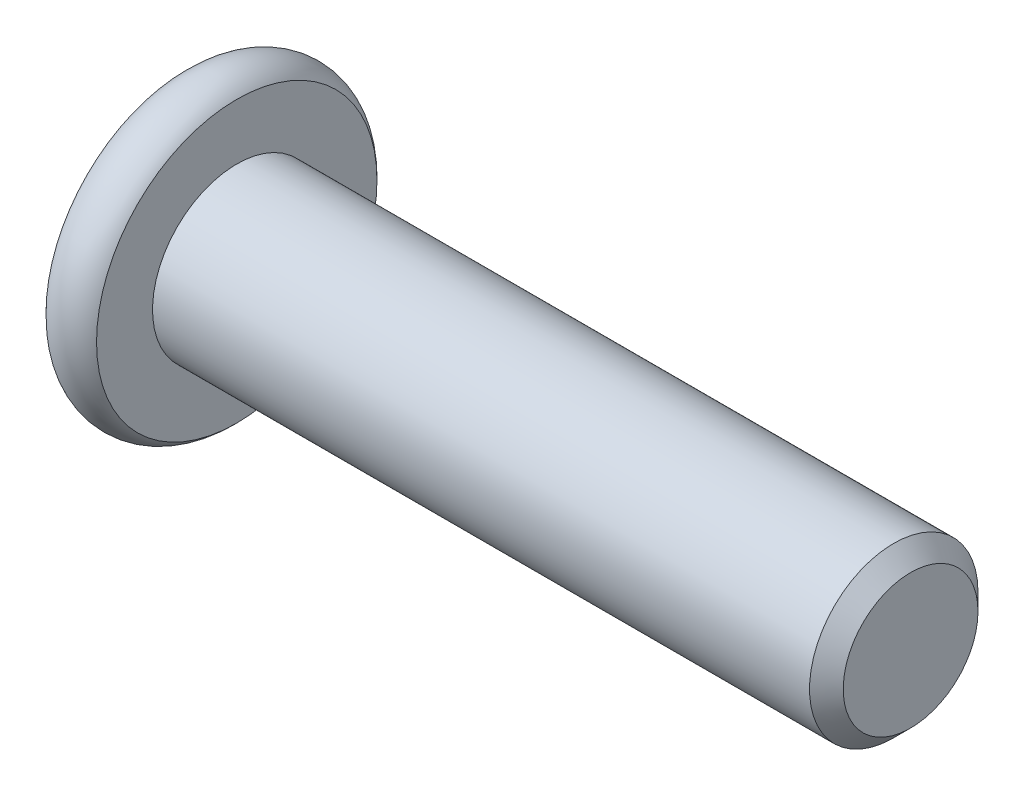
ISO-10303-21;
HEADER;
FILE_DESCRIPTION(('STEP AP214'),'2;1');
FILE_NAME('part.step','',(''),(''),'','','');
FILE_SCHEMA(('AUTOMOTIVE_DESIGN { 1 0 10303 214 1 1 1 1 }'));
ENDSEC;
DATA;
#1=APPLICATION_CONTEXT('core data for automotive mechanical design processes');
#2=APPLICATION_PROTOCOL_DEFINITION('international standard','automotive_design',2000,#1);
#3=PRODUCT_CONTEXT('',#1,'mechanical');
#4=PRODUCT('Part','Part','',(#3));
#5=PRODUCT_RELATED_PRODUCT_CATEGORY('part','',(#4));
#6=PRODUCT_DEFINITION_FORMATION('','',#4);
#7=PRODUCT_DEFINITION_CONTEXT('part definition',#1,'design');
#8=PRODUCT_DEFINITION('design','',#6,#7);
#9=PRODUCT_DEFINITION_SHAPE('','',#8);
#10=(LENGTH_UNIT() NAMED_UNIT(*) SI_UNIT(.MILLI.,.METRE.));
#11=(NAMED_UNIT(*) PLANE_ANGLE_UNIT() SI_UNIT($,.RADIAN.));
#12=(NAMED_UNIT(*) SI_UNIT($,.STERADIAN.) SOLID_ANGLE_UNIT());
#13=UNCERTAINTY_MEASURE_WITH_UNIT(LENGTH_MEASURE(1.E-05),#10,'distance_accuracy_value','');
#14=(GEOMETRIC_REPRESENTATION_CONTEXT(3) GLOBAL_UNCERTAINTY_ASSIGNED_CONTEXT((#13)) GLOBAL_UNIT_ASSIGNED_CONTEXT((#10,
#11,#12)) REPRESENTATION_CONTEXT('',''));
#15=CARTESIAN_POINT('',(0.,0.,0.));
#16=DIRECTION('',(0.,0.,1.));
#17=DIRECTION('',(1.,0.,0.));
#18=AXIS2_PLACEMENT_3D('',#15,#16,#17);
#19=CARTESIAN_POINT('',(-20.,0.,2.22044604925031E-13));
#20=DIRECTION('',(1.,0.,0.));
#21=DIRECTION('',(0.,0.,-1.));
#22=AXIS2_PLACEMENT_3D('',#19,#20,#21);
#23=CYLINDRICAL_SURFACE('',#22,2.5);
#24=CARTESIAN_POINT('',(-0.500000000000056,0.,0.));
#25=DIRECTION('',(1.,0.,0.));
#26=DIRECTION('',(0.,0.,-1.));
#27=AXIS2_PLACEMENT_3D('',#24,#25,#26);
#28=CIRCLE('',#27,2.5);
#29=CARTESIAN_POINT('',(-0.500000000000056,0.,-2.5));
#30=VERTEX_POINT('',#29);
#31=EDGE_CURVE('E51',#30,#30,#28,.F.);
#32=ORIENTED_EDGE('',*,*,#31,.T.);
#33=EDGE_LOOP('',(#32));
#34=FACE_BOUND('',#33,.T.);
#35=CARTESIAN_POINT('',(-20.,0.,2.22044604925031E-13));
#36=DIRECTION('',(-1.,0.,0.));
#37=DIRECTION('',(0.,-1.,0.));
#38=AXIS2_PLACEMENT_3D('',#35,#36,#37);
#39=CIRCLE('',#38,2.5);
#40=CARTESIAN_POINT('',(-20.,-2.50000000000006,2.22183382803109E-13));
#41=VERTEX_POINT('',#40);
#42=EDGE_CURVE('E127',#41,#41,#39,.F.);
#43=ORIENTED_EDGE('',*,*,#42,.T.);
#44=EDGE_LOOP('',(#43));
#45=FACE_BOUND('',#44,.T.);
#46=ADVANCED_FACE('F37',(#34,#45),#23,.T.);
#47=CARTESIAN_POINT('',(0.,0.,0.));
#48=DIRECTION('',(1.,0.,0.));
#49=DIRECTION('',(0.,0.,-1.));
#50=AXIS2_PLACEMENT_3D('',#47,#48,#49);
#51=PLANE('',#50);
#52=CARTESIAN_POINT('',(0.,0.,0.));
#53=DIRECTION('',(1.,0.,0.));
#54=DIRECTION('',(0.,0.,-1.));
#55=AXIS2_PLACEMENT_3D('',#52,#53,#54);
#56=CIRCLE('',#55,2.);
#57=CARTESIAN_POINT('',(0.,0.,-2.));
#58=VERTEX_POINT('',#57);
#59=EDGE_CURVE('E130',#58,#58,#56,.T.);
#60=ORIENTED_EDGE('',*,*,#59,.T.);
#61=EDGE_LOOP('',(#60));
#62=FACE_BOUND('',#61,.T.);
#63=ADVANCED_FACE('F140',(#62),#51,.T.);
#64=CARTESIAN_POINT('',(0.,0.,0.));
#65=DIRECTION('',(-1.,0.,0.));
#66=DIRECTION('',(0.,0.,1.));
#67=AXIS2_PLACEMENT_3D('',#64,#65,#66);
#68=CONICAL_SURFACE('',#67,2.,0.785398163397446);
#69=ORIENTED_EDGE('',*,*,#31,.F.);
#70=EDGE_LOOP('',(#69));
#71=FACE_BOUND('',#70,.T.);
#72=ORIENTED_EDGE('',*,*,#59,.F.);
#73=EDGE_LOOP('',(#72));
#74=FACE_BOUND('',#73,.T.);
#75=ADVANCED_FACE('F39',(#71,#74),#68,.T.);
#76=CARTESIAN_POINT('',(-21.5,0.,2.22044604925031E-13));
#77=DIRECTION('',(1.,0.,0.));
#78=DIRECTION('',(0.,1.,0.));
#79=AXIS2_PLACEMENT_3D('',#76,#77,#78);
#80=PLANE('',#79);
#81=CARTESIAN_POINT('',(-21.5,1.66533453693773E-13,0.));
#82=DIRECTION('',(-1.,0.,0.));
#83=DIRECTION('',(0.,-1.,0.));
#84=AXIS2_PLACEMENT_3D('',#81,#82,#83);
#85=CIRCLE('',#84,1.78205080756886);
#86=CARTESIAN_POINT('',(-21.5,-1.78205080756869,0.));
#87=VERTEX_POINT('',#86);
#88=EDGE_CURVE('E245',#87,#87,#85,.T.);
#89=ORIENTED_EDGE('',*,*,#88,.F.);
#90=EDGE_LOOP('',(#89));
#91=FACE_BOUND('',#90,.T.);
#92=CARTESIAN_POINT('',(-21.5,0.,2.22044604925031E-13));
#93=DIRECTION('',(-1.,0.,0.));
#94=DIRECTION('',(0.,-1.,0.));
#95=AXIS2_PLACEMENT_3D('',#92,#93,#94);
#96=CIRCLE('',#95,4.16143782776615);
#97=CARTESIAN_POINT('',(-21.5,-4.16143782776621,2.22275611129628E-13));
#98=VERTEX_POINT('',#97);
#99=EDGE_CURVE('E124',#98,#98,#96,.T.);
#100=ORIENTED_EDGE('',*,*,#99,.T.);
#101=EDGE_LOOP('',(#100));
#102=FACE_BOUND('',#101,.T.);
#103=ADVANCED_FACE('F139',(#91,#102),#80,.F.);
#104=CARTESIAN_POINT('',(-20.75,0.,2.22044604925031E-13));
#105=DIRECTION('',(-1.,0.,0.));
#106=DIRECTION('',(0.,-1.,0.));
#107=AXIS2_PLACEMENT_3D('',#104,#105,#106);
#108=TOROIDAL_SURFACE('',#107,3.5,1.);
#109=ORIENTED_EDGE('',*,*,#99,.F.);
#110=EDGE_LOOP('',(#109));
#111=FACE_BOUND('',#110,.T.);
#112=CARTESIAN_POINT('',(-20.,0.,2.22044604925031E-13));
#113=DIRECTION('',(-1.,0.,0.));
#114=DIRECTION('',(0.,-1.,0.));
#115=AXIS2_PLACEMENT_3D('',#112,#113,#114);
#116=CIRCLE('',#115,4.16143782776615);
#117=CARTESIAN_POINT('',(-20.,-4.16143782776621,2.22275611129628E-13));
#118=VERTEX_POINT('',#117);
#119=EDGE_CURVE('E121',#118,#118,#116,.T.);
#120=ORIENTED_EDGE('',*,*,#119,.T.);
#121=EDGE_LOOP('',(#120));
#122=FACE_BOUND('',#121,.T.);
#123=ADVANCED_FACE('F151',(#111,#122),#108,.T.);
#124=CARTESIAN_POINT('',(-20.,4.16143782776629,2.22044604925031E-13));
#125=DIRECTION('',(-1.,0.,0.));
#126=DIRECTION('',(0.,-1.,0.));
#127=AXIS2_PLACEMENT_3D('',#124,#125,#126);
#128=PLANE('',#127);
#129=ORIENTED_EDGE('',*,*,#42,.F.);
#130=EDGE_LOOP('',(#129));
#131=FACE_BOUND('',#130,.T.);
#132=ORIENTED_EDGE('',*,*,#119,.F.);
#133=EDGE_LOOP('',(#132));
#134=FACE_BOUND('',#133,.T.);
#135=ADVANCED_FACE('F155',(#131,#134),#128,.F.);
#136=CARTESIAN_POINT('',(-21.5,1.66533453693773E-13,0.));
#137=DIRECTION('',(-1.,0.,0.));
#138=DIRECTION('',(0.,-1.,0.));
#139=AXIS2_PLACEMENT_3D('',#136,#137,#138);
#140=CONICAL_SURFACE('',#139,1.78205080756886,0.78539816339745);
#141=ORIENTED_EDGE('',*,*,#88,.T.);
#142=EDGE_LOOP('',(#141));
#143=FACE_BOUND('',#142,.T.);
#144=CARTESIAN_POINT('',(-22.015428085613,-1.74023253176592,1.50000000000039));
#145=CARTESIAN_POINT('',(-21.9833811073447,-1.69791724929735,1.50000000000032));
#146=CARTESIAN_POINT('',(-21.9516444672843,-1.65536760966792,1.50000000000029));
#147=CARTESIAN_POINT('',(-21.8889203936156,-1.56970398156683,1.50000000000027));
#148=CARTESIAN_POINT('',(-21.8579331482203,-1.52658985542849,1.50000000000028));
#149=CARTESIAN_POINT('',(-21.7658461643452,-1.39562626326564,1.50000000000028));
#150=CARTESIAN_POINT('',(-21.7061145123023,-1.30679868010574,1.50000000000026));
#151=CARTESIAN_POINT('',(-21.5887342891015,-1.12044622640207,1.5000000000003));
#152=CARTESIAN_POINT('',(-21.5314082774826,-1.0227158730666,1.50000000000037));
#153=CARTESIAN_POINT('',(-21.4264632149761,-0.822357214965245,1.50000000000019));
#154=CARTESIAN_POINT('',(-21.3788114236894,-0.719746931702063,1.49999999999994));
#155=CARTESIAN_POINT('',(-21.3205099883151,-0.56585238709519,1.50000000000011));
#156=CARTESIAN_POINT('',(-21.3037990535411,-0.51687419142472,1.50000000000024));
#157=CARTESIAN_POINT('',(-21.2743077515092,-0.41772398845751,1.50000000000032));
#158=CARTESIAN_POINT('',(-21.2615276514222,-0.367551900263887,1.50000000000027));
#159=CARTESIAN_POINT('',(-21.240778420246,-0.267158299056132,1.50000000000028));
#160=CARTESIAN_POINT('',(-21.2327260618263,-0.216954261864853,1.50000000000034));
#161=CARTESIAN_POINT('',(-21.2215916368342,-0.115994915871317,1.50000000000022));
#162=CARTESIAN_POINT('',(-21.2185086886377,-0.0652397064615469,1.50000000000005));
#163=CARTESIAN_POINT('',(-21.2175473897404,0.0344222234875186,1.50000000000006));
#164=CARTESIAN_POINT('',(-21.2194789216953,0.0833271701100345,1.50000000000022));
#165=CARTESIAN_POINT('',(-21.228017572968,0.18072429312715,1.50000000000033));
#166=CARTESIAN_POINT('',(-21.2346251420483,0.229216429361659,1.50000000000028));
#167=CARTESIAN_POINT('',(-21.2522650626449,0.32625802769693,1.50000000000027));
#168=CARTESIAN_POINT('',(-21.2633731682012,0.37479350744994,1.50000000000032));
#169=CARTESIAN_POINT('',(-21.2894198669597,0.470802295834104,1.50000000000024));
#170=CARTESIAN_POINT('',(-21.3043581560035,0.518275688481227,1.50000000000011));
#171=CARTESIAN_POINT('',(-21.3568395457159,0.667150562065092,1.49999999999994));
#172=CARTESIAN_POINT('',(-21.4003351165442,0.766448362426739,1.50000000000019));
#173=CARTESIAN_POINT('',(-21.4970587814838,0.960384405673684,1.50000000000037));
#174=CARTESIAN_POINT('',(-21.5503217226675,1.05500437383609,1.50000000000031));
#175=CARTESIAN_POINT('',(-21.6602258010454,1.23584520321524,1.50000000000025));
#176=CARTESIAN_POINT('',(-21.7165682531047,1.32224986946543,1.50000000000026));
#177=CARTESIAN_POINT('',(-21.8036755725971,1.44954953726468,1.50000000000029));
#178=CARTESIAN_POINT('',(-21.8330199906839,1.49143368482417,1.5000000000003));
#179=CARTESIAN_POINT('',(-21.8924869182931,1.57462914783238,1.50000000000026));
#180=CARTESIAN_POINT('',(-21.9226092115007,1.61594061772573,1.50000000000019));
#181=CARTESIAN_POINT('',(-21.9530541181365,1.65701358742548,1.50000000000006));
#182=B_SPLINE_CURVE_WITH_KNOTS('',3,(#144,#145,#146,#147,#148,#149,#150,#151,#152,#153,#154,
#155,#156,#157,#158,#159,#160,#161,#162,#163,#164,#165,#166,#167,#168,#169,#170,#171,#172,#173,
#174,#175,#176,#177,#178,#179,#180,#181),.UNSPECIFIED.,.F.,.F.,(4,2,2,2,2,2,2,2,2,2,2,2,2,2,2,2,
2,2,4),(0.,0.159238974218315,0.318517535014476,0.639504781932392,0.979137893799231,
1.31760168934353,1.47272233841619,1.62785352839773,1.78016486537347,1.93244917778278,
2.07904486260292,2.22565464958326,2.37484213303392,2.52401777304029,2.8482836528376,
3.17372975666736,3.48303030530528,3.63644667013898,3.78982082222899),.UNSPECIFIED.);
#183=CARTESIAN_POINT('',(-21.4500000000001,-0.866025403784554,1.50000000000028));
#184=VERTEX_POINT('',#183);
#185=CARTESIAN_POINT('',(-21.45,0.866025403784387,1.50000000000017));
#186=VERTEX_POINT('',#185);
#187=EDGE_CURVE('E105',#184,#186,#182,.T.);
#188=ORIENTED_EDGE('',*,*,#187,.F.);
#189=CARTESIAN_POINT('',(-21.4501154816001,-1.73216627762274,-0.000199999999672684));
#190=CARTESIAN_POINT('',(-21.4203654760676,-1.70239359975924,0.0513677907374837));
#191=CARTESIAN_POINT('',(-21.3923624839106,-1.67212305186367,0.103797917665623));
#192=CARTESIAN_POINT('',(-21.3410892304405,-1.61039789003631,0.21070903405604));
#193=CARTESIAN_POINT('',(-21.3178475050447,-1.57893740312624,0.265200195815113));
#194=CARTESIAN_POINT('',(-21.2780337289926,-1.51549879897996,0.375079081357747));
#195=CARTESIAN_POINT('',(-21.2613615856714,-1.48353684526821,0.430438809095736));
#196=CARTESIAN_POINT('',(-21.2356744568184,-1.41890915196216,0.542377257477631));
#197=CARTESIAN_POINT('',(-21.2266402904789,-1.38624538781116,0.598952556553395));
#198=CARTESIAN_POINT('',(-21.218489081227,-1.32995210095303,0.696455389516801));
#199=CARTESIAN_POINT('',(-21.2172822529896,-1.30639533311136,0.737256908280851));
#200=CARTESIAN_POINT('',(-21.2193140571628,-1.25932335290211,0.818787969616243));
#201=CARTESIAN_POINT('',(-21.2225536707488,-1.23580815085328,0.859517494314989));
#202=CARTESIAN_POINT('',(-21.2332919859824,-1.18900414978446,0.940584402163756));
#203=CARTESIAN_POINT('',(-21.2407946530193,-1.16571558211746,0.980921384598634));
#204=CARTESIAN_POINT('',(-21.2596516119287,-1.11952932016346,1.0609183369143));
#205=CARTESIAN_POINT('',(-21.2710075570187,-1.09663179808774,1.10057800851639));
#206=CARTESIAN_POINT('',(-21.3047216475926,-1.03798159809673,1.2021631347746));
#207=CARTESIAN_POINT('',(-21.3296218490937,-1.00259267147477,1.26345855370988));
#208=CARTESIAN_POINT('',(-21.371656653272,-0.950557780604678,1.35358562846354));
#209=CARTESIAN_POINT('',(-21.3864251535596,-0.933410759677447,1.38328513990795));
#210=CARTESIAN_POINT('',(-21.4173105659405,-0.899432101996583,1.44213790138397));
#211=CARTESIAN_POINT('',(-21.4334268341219,-0.882600319285768,1.47129140422083));
#212=CARTESIAN_POINT('',(-21.4501154816001,-0.86590993373048,1.50020000000017));
#213=B_SPLINE_CURVE_WITH_KNOTS('',3,(#189,#190,#191,#192,#193,#194,#195,#196,#197,#198,#199,
#200,#201,#202,#203,#204,#205,#206,#207,#208,#209,#210,#211,#212),.UNSPECIFIED.,.F.,.F.,(4,2,2,
2,2,2,2,2,2,2,2,4),(0.,0.199829143693217,0.400822987382367,0.598623720538195,0.795926240188856,
0.937113067959762,1.07833105577178,1.21968061668202,1.36109089931028,1.58570969637538,
1.69770705470938,1.80965120737165),.UNSPECIFIED.);
#214=CARTESIAN_POINT('',(-21.4500000000001,-1.732050807569,4.44089209850063E-13));
#215=VERTEX_POINT('',#214);
#216=EDGE_CURVE('E201',#215,#184,#213,.T.);
#217=ORIENTED_EDGE('',*,*,#216,.F.);
#218=CARTESIAN_POINT('',(-21.4501154816001,-0.865909933730591,-1.50019999999984));
#219=CARTESIAN_POINT('',(-21.4203654760674,-0.895682611594249,-1.44863220926284));
#220=CARTESIAN_POINT('',(-21.3923624839104,-0.925953159489866,-1.39620208233474));
#221=CARTESIAN_POINT('',(-21.3410892304403,-0.987678321317225,-1.28929096594437));
#222=CARTESIAN_POINT('',(-21.3178475050445,-1.01913880822726,-1.2347998041853));
#223=CARTESIAN_POINT('',(-21.2780337289924,-1.08257741237355,-1.12492091864272));
#224=CARTESIAN_POINT('',(-21.2613615856711,-1.11453936608537,-1.06956119090479));
#225=CARTESIAN_POINT('',(-21.2356744568182,-1.17916705939124,-0.95762274252279));
#226=CARTESIAN_POINT('',(-21.2266402904789,-1.21183082354201,-0.901047443446861));
#227=CARTESIAN_POINT('',(-21.2184890812269,-1.26812411040024,-0.80354461048347));
#228=CARTESIAN_POINT('',(-21.2172822529894,-1.29168087824212,-0.762743091719508));
#229=CARTESIAN_POINT('',(-21.2193140571625,-1.33875285845151,-0.681212030384146));
#230=CARTESIAN_POINT('',(-21.2225536707485,-1.36226806050028,-0.640482505685342));
#231=CARTESIAN_POINT('',(-21.2332919859822,-1.40907206156915,-0.559415597836548));
#232=CARTESIAN_POINT('',(-21.240794653019,-1.43236062923625,-0.519078615401701));
#233=CARTESIAN_POINT('',(-21.2596516119285,-1.47854689119004,-0.439081663085886));
#234=CARTESIAN_POINT('',(-21.2710075570186,-1.50144441326544,-0.399421991483613));
#235=CARTESIAN_POINT('',(-21.3047216475926,-1.56009461325624,-0.297836865225293));
#236=CARTESIAN_POINT('',(-21.3296218490935,-1.5954835398787,-0.236541446290254));
#237=CARTESIAN_POINT('',(-21.3716566532718,-1.64751843074903,-0.146414371536723));
#238=CARTESIAN_POINT('',(-21.3864251535594,-1.66466545167626,-0.116714860092322));
#239=CARTESIAN_POINT('',(-21.4173105659404,-1.69864410935695,-0.057862098616249));
#240=CARTESIAN_POINT('',(-21.4334268341218,-1.71547589206759,-0.0287085957793187));
#241=CARTESIAN_POINT('',(-21.4501154816001,-1.73216627762263,0.000200000000116773));
#242=B_SPLINE_CURVE_WITH_KNOTS('',3,(#218,#219,#220,#221,#222,#223,#224,#225,#226,#227,#228,
#229,#230,#231,#232,#233,#234,#235,#236,#237,#238,#239,#240,#241),.UNSPECIFIED.,.F.,.F.,(4,2,2,
2,2,2,2,2,2,2,2,4),(0.,0.199829143693239,0.400822987382314,0.598623720538103,0.795926240188776,
0.937113067959776,1.07833105577185,1.21968061668216,1.3610908993105,1.58570969637556,
1.69770705470953,1.8096512073718),.UNSPECIFIED.);
#243=CARTESIAN_POINT('',(-21.4500000000001,-0.866025403784554,-1.49999999999995));
#244=VERTEX_POINT('',#243);
#245=EDGE_CURVE('E195',#244,#215,#242,.T.);
#246=ORIENTED_EDGE('',*,*,#245,.F.);
#247=CARTESIAN_POINT('',(-22.015428085613,-1.74023253176575,-1.49999999999972));
#248=CARTESIAN_POINT('',(-21.9833811073446,-1.69791724929724,-1.5));
#249=CARTESIAN_POINT('',(-21.9516444672842,-1.65536760966783,-1.50000000000012));
#250=CARTESIAN_POINT('',(-21.8889203936154,-1.56970398156675,-1.50000000000021));
#251=CARTESIAN_POINT('',(-21.8579331482201,-1.52658985542839,-1.50000000000019));
#252=CARTESIAN_POINT('',(-21.7658461643451,-1.39562626326554,-1.50000000000013));
#253=CARTESIAN_POINT('',(-21.7061145123022,-1.30679868010565,-1.50000000000013));
#254=CARTESIAN_POINT('',(-21.5887342891013,-1.12044622640201,-1.50000000000021));
#255=CARTESIAN_POINT('',(-21.5314082774824,-1.02271587306655,-1.5000000000003));
#256=CARTESIAN_POINT('',(-21.426463214976,-0.822357214965113,-1.50000000000003));
#257=CARTESIAN_POINT('',(-21.3788114236895,-0.719746931701838,-1.49999999999967));
#258=CARTESIAN_POINT('',(-21.320509988315,-0.56585238709499,-1.49999999999991));
#259=CARTESIAN_POINT('',(-21.303799053541,-0.516874191424563,-1.5000000000001));
#260=CARTESIAN_POINT('',(-21.2743077515091,-0.417723988457403,-1.50000000000023));
#261=CARTESIAN_POINT('',(-21.2615276514221,-0.367551900263786,-1.50000000000018));
#262=CARTESIAN_POINT('',(-21.2407784202459,-0.26715829905606,-1.50000000000016));
#263=CARTESIAN_POINT('',(-21.2327260618261,-0.216954261864804,-1.50000000000019));
#264=CARTESIAN_POINT('',(-21.2215916368341,-0.115994915871298,-1.50000000000014));
#265=CARTESIAN_POINT('',(-21.2185086886377,-0.0652397064615371,-1.50000000000005));
#266=CARTESIAN_POINT('',(-21.2175473897404,0.0344222234875172,-1.50000000000006));
#267=CARTESIAN_POINT('',(-21.2194789216952,0.0833271701100311,-1.50000000000014));
#268=CARTESIAN_POINT('',(-21.2280175729678,0.180724293127133,-1.50000000000019));
#269=CARTESIAN_POINT('',(-21.2346251420481,0.22921642936163,-1.50000000000016));
#270=CARTESIAN_POINT('',(-21.2522650626448,0.326258027696887,-1.50000000000018));
#271=CARTESIAN_POINT('',(-21.263373168201,0.374793507449896,-1.50000000000023));
#272=CARTESIAN_POINT('',(-21.2894198669596,0.470802295834032,-1.5000000000001));
#273=CARTESIAN_POINT('',(-21.3043581560035,0.518275688481128,-1.49999999999991));
#274=CARTESIAN_POINT('',(-21.3568395457159,0.667150562064988,-1.49999999999967));
#275=CARTESIAN_POINT('',(-21.4003351165442,0.766448362426712,-1.50000000000003));
#276=CARTESIAN_POINT('',(-21.4970587814836,0.960384405673728,-1.5000000000003));
#277=CARTESIAN_POINT('',(-21.5503217226675,1.05500437383613,-1.5000000000002));
#278=CARTESIAN_POINT('',(-21.6602258010453,1.23584520321528,-1.50000000000013));
#279=CARTESIAN_POINT('',(-21.7165682531046,1.32224986946547,-1.50000000000015));
#280=CARTESIAN_POINT('',(-21.803675572597,1.44954953726472,-1.50000000000017));
#281=CARTESIAN_POINT('',(-21.8330199906839,1.49143368482422,-1.50000000000018));
#282=CARTESIAN_POINT('',(-21.892486918293,1.57462914783244,-1.50000000000015));
#283=CARTESIAN_POINT('',(-21.9226092115007,1.61594061772579,-1.50000000000012));
#284=CARTESIAN_POINT('',(-21.9530541181365,1.65701358742554,-1.50000000000006));
#285=B_SPLINE_CURVE_WITH_KNOTS('',3,(#247,#248,#249,#250,#251,#252,#253,#254,#255,#256,#257,
#258,#259,#260,#261,#262,#263,#264,#265,#266,#267,#268,#269,#270,#271,#272,#273,#274,#275,#276,
#277,#278,#279,#280,#281,#282,#283,#284),.UNSPECIFIED.,.F.,.F.,(4,2,2,2,2,2,2,2,2,2,2,2,2,2,2,2,
2,2,4),(0.,0.159238974218338,0.318517535014512,0.639504781932395,0.979137893799249,
1.31760168934362,1.47272233841624,1.62785352839773,1.78016486537341,1.93244917778268,
2.07904486260281,2.22565464958312,2.37484213303376,2.52401777304011,2.8482836528375,
3.17372975666731,3.48303030530522,3.63644667013894,3.78982082222898),.UNSPECIFIED.);
#286=CARTESIAN_POINT('',(-21.45,0.866025403784332,-1.50000000000017));
#287=VERTEX_POINT('',#286);
#288=EDGE_CURVE('E58',#287,#244,#285,.F.);
#289=ORIENTED_EDGE('',*,*,#288,.F.);
#290=CARTESIAN_POINT('',(-21.4501154816001,1.73216627762252,0.000200000000338818));
#291=CARTESIAN_POINT('',(-21.4203654760673,1.70239359975915,-0.0513677907368243));
#292=CARTESIAN_POINT('',(-21.3923624839102,1.67212305186364,-0.103797917665));
#293=CARTESIAN_POINT('',(-21.3410892304401,1.61039789003635,-0.210709034055433));
#294=CARTESIAN_POINT('',(-21.3178475050443,1.57893740312629,-0.265200195814482));
#295=CARTESIAN_POINT('',(-21.2780337289921,1.51549879897999,-0.375079081357035));
#296=CARTESIAN_POINT('',(-21.2613615856707,1.4835368452682,-0.430438809094967));
#297=CARTESIAN_POINT('',(-21.235674456818,1.41890915196228,-0.54237725747699));
#298=CARTESIAN_POINT('',(-21.226640290479,1.38624538781144,-0.598952556552939));
#299=CARTESIAN_POINT('',(-21.2184890812269,1.3299521009532,-0.696455389516378));
#300=CARTESIAN_POINT('',(-21.2172822529891,1.30639533311136,-0.737256908280361));
#301=CARTESIAN_POINT('',(-21.2193140571621,1.25932335290199,-0.818787969615715));
#302=CARTESIAN_POINT('',(-21.2225536707481,1.2358081508532,-0.859517494314492));
#303=CARTESIAN_POINT('',(-21.2332919859818,1.18900414978437,-0.940584402163314));
#304=CARTESIAN_POINT('',(-21.2407946530185,1.16571558211734,-0.980921384598216));
#305=CARTESIAN_POINT('',(-21.2596516119282,1.11952932016337,-1.06091833691387));
#306=CARTESIAN_POINT('',(-21.2710075570186,1.09663179808773,-1.10057800851593));
#307=CARTESIAN_POINT('',(-21.3047216475927,1.03798159809675,-1.20216313477417));
#308=CARTESIAN_POINT('',(-21.3296218490933,1.00259267147464,-1.26345855370959));
#309=CARTESIAN_POINT('',(-21.3716566532714,0.950557780604432,-1.35358562846332));
#310=CARTESIAN_POINT('',(-21.386425153559,0.933410759677186,-1.38328513990773));
#311=CARTESIAN_POINT('',(-21.4173105659401,0.899432101996403,-1.44213790138374));
#312=CARTESIAN_POINT('',(-21.4334268341217,0.882600319285683,-1.4712914042206));
#313=CARTESIAN_POINT('',(-21.4501154816001,0.865909933730591,-1.50019999999995));
#314=B_SPLINE_CURVE_WITH_KNOTS('',3,(#290,#291,#292,#293,#294,#295,#296,#297,#298,#299,#300,
#301,#302,#303,#304,#305,#306,#307,#308,#309,#310,#311,#312,#313),.UNSPECIFIED.,.F.,.F.,(4,2,2,
2,2,2,2,2,2,2,2,4),(0.,0.199829143693358,0.400822987382412,0.598623720538207,0.795926240188963,
0.937113067959984,1.07833105577203,1.21968061668233,1.36109089931066,1.58570969637585,
1.69770705470987,1.80965120737222),.UNSPECIFIED.);
#315=CARTESIAN_POINT('',(-21.45,1.73205080756905,0.));
#316=VERTEX_POINT('',#315);
#317=EDGE_CURVE('E11',#316,#287,#314,.T.);
#318=ORIENTED_EDGE('',*,*,#317,.F.);
#319=CARTESIAN_POINT('',(-21.4501154816001,0.865909933730757,1.50020000000017));
#320=CARTESIAN_POINT('',(-21.4203654760673,0.8956826115942,1.44863220926306));
#321=CARTESIAN_POINT('',(-21.3923624839103,0.925953159489757,1.39620208233493));
#322=CARTESIAN_POINT('',(-21.3410892304401,0.987678321317076,1.28929096594456));
#323=CARTESIAN_POINT('',(-21.3178475050444,1.01913880822713,1.23479980418552));
#324=CARTESIAN_POINT('',(-21.2780337289922,1.08257741237336,1.12492091864298));
#325=CARTESIAN_POINT('',(-21.2613615856708,1.11453936608509,1.06956119090503));
#326=CARTESIAN_POINT('',(-21.2356744568181,1.17916705939113,0.957622742523144));
#327=CARTESIAN_POINT('',(-21.226640290479,1.21183082354216,0.901047443447341));
#328=CARTESIAN_POINT('',(-21.2184890812269,1.26812411040032,0.803544610483884));
#329=CARTESIAN_POINT('',(-21.2172822529891,1.291680878242,0.762743091719809));
#330=CARTESIAN_POINT('',(-21.2193140571621,1.33875285845126,0.681212030384383));
#331=CARTESIAN_POINT('',(-21.2225536707482,1.36226806050009,0.640482505685627));
#332=CARTESIAN_POINT('',(-21.2332919859818,1.40907206156896,0.559415597836825));
#333=CARTESIAN_POINT('',(-21.2407946530185,1.43236062923601,0.519078615401922));
#334=CARTESIAN_POINT('',(-21.2596516119281,1.47854689118992,0.439081663086229));
#335=CARTESIAN_POINT('',(-21.2710075570186,1.5014444132655,0.399421991484134));
#336=CARTESIAN_POINT('',(-21.3047216475927,1.56009461325645,0.297836865225866));
#337=CARTESIAN_POINT('',(-21.3296218490932,1.59548353987867,0.236541446290483));
#338=CARTESIAN_POINT('',(-21.3716566532714,1.64751843074893,0.146414371536749));
#339=CARTESIAN_POINT('',(-21.3864251535589,1.66466545167618,0.116714860092335));
#340=CARTESIAN_POINT('',(-21.41731056594,1.69864410935694,0.057862098616311));
#341=CARTESIAN_POINT('',(-21.4334268341217,1.71547589206765,0.0287085957794427));
#342=CARTESIAN_POINT('',(-21.4501154816001,1.73216627762274,-0.000199999999894729));
#343=B_SPLINE_CURVE_WITH_KNOTS('',3,(#319,#320,#321,#322,#323,#324,#325,#326,#327,#328,#329,
#330,#331,#332,#333,#334,#335,#336,#337,#338,#339,#340,#341,#342),.UNSPECIFIED.,.F.,.F.,(4,2,2,
2,2,2,2,2,2,2,2,4),(0.,0.199829143693294,0.400822987382295,0.598623720538023,0.795926240188707,
0.937113067959731,1.07833105577178,1.21968061668208,1.36109089931043,1.58570969637565,
1.69770705470968,1.80965120737205),.UNSPECIFIED.);
#344=EDGE_CURVE('E96',#186,#316,#343,.T.);
#345=ORIENTED_EDGE('',*,*,#344,.F.);
#346=EDGE_LOOP('',(#188,#217,#246,#289,#318,#345));
#347=FACE_BOUND('',#346,.T.);
#348=ADVANCED_FACE('F95',(#143,#347),#140,.F.);
#349=CARTESIAN_POINT('',(-19.2,1.11022302462516E-13,2.22044604925031E-13));
#350=DIRECTION('',(-1.,0.,0.));
#351=DIRECTION('',(0.,-1.,0.));
#352=AXIS2_PLACEMENT_3D('',#349,#350,#351);
#353=PLANE('',#352);
#354=DIRECTION('',(0.,0.5,-0.866025403784439));
#355=VECTOR('',#354,1.);
#356=CARTESIAN_POINT('',(-19.2,0.866025403784387,1.50000000000017));
#357=LINE('',#356,#355);
#358=CARTESIAN_POINT('',(-19.2,0.866025403784387,1.50000000000017));
#359=VERTEX_POINT('',#358);
#360=CARTESIAN_POINT('',(-19.2,1.73205080756889,0.));
#361=VERTEX_POINT('',#360);
#362=EDGE_CURVE('E104',#359,#361,#357,.T.);
#363=ORIENTED_EDGE('',*,*,#362,.T.);
#364=DIRECTION('',(0.,-0.5,-0.86602540378444));
#365=VECTOR('',#364,1.);
#366=CARTESIAN_POINT('',(-19.2,1.73205080756889,0.));
#367=LINE('',#366,#365);
#368=CARTESIAN_POINT('',(-19.2,0.866025403784332,-1.50000000000017));
#369=VERTEX_POINT('',#368);
#370=EDGE_CURVE('E109',#361,#369,#367,.T.);
#371=ORIENTED_EDGE('',*,*,#370,.T.);
#372=DIRECTION('',(0.,-1.,0.));
#373=VECTOR('',#372,1.);
#374=CARTESIAN_POINT('',(-19.2,0.866025403784332,-1.50000000000017));
#375=LINE('',#374,#373);
#376=CARTESIAN_POINT('',(-19.2,-0.866025403784554,-1.49999999999995));
#377=VERTEX_POINT('',#376);
#378=EDGE_CURVE('E227',#369,#377,#375,.T.);
#379=ORIENTED_EDGE('',*,*,#378,.T.);
#380=DIRECTION('',(0.,-0.5,0.866025403784439));
#381=VECTOR('',#380,1.);
#382=CARTESIAN_POINT('',(-19.2,-0.866025403784554,-1.49999999999995));
#383=LINE('',#382,#381);
#384=CARTESIAN_POINT('',(-19.2,-1.732050807569,4.44089209850063E-13));
#385=VERTEX_POINT('',#384);
#386=EDGE_CURVE('E231',#377,#385,#383,.T.);
#387=ORIENTED_EDGE('',*,*,#386,.T.);
#388=DIRECTION('',(0.,0.5,0.86602540378444));
#389=VECTOR('',#388,1.);
#390=CARTESIAN_POINT('',(-19.2,-1.732050807569,4.44089209850063E-13));
#391=LINE('',#390,#389);
#392=CARTESIAN_POINT('',(-19.2,-0.866025403784554,1.50000000000028));
#393=VERTEX_POINT('',#392);
#394=EDGE_CURVE('E117',#385,#393,#391,.T.);
#395=ORIENTED_EDGE('',*,*,#394,.T.);
#396=DIRECTION('',(0.,1.,0.));
#397=VECTOR('',#396,1.);
#398=CARTESIAN_POINT('',(-19.2,-0.866025403784554,1.50000000000028));
#399=LINE('',#398,#397);
#400=EDGE_CURVE('E112',#393,#359,#399,.T.);
#401=ORIENTED_EDGE('',*,*,#400,.T.);
#402=EDGE_LOOP('',(#363,#371,#379,#387,#395,#401));
#403=FACE_BOUND('',#402,.T.);
#404=ADVANCED_FACE('F181',(#403),#353,.T.);
#405=CARTESIAN_POINT('',(-19.2,1.73205080756889,0.));
#406=DIRECTION('',(0.,0.866025403784439,-0.5));
#407=DIRECTION('',(0.,0.5,0.866025403784439));
#408=AXIS2_PLACEMENT_3D('',#405,#406,#407);
#409=PLANE('',#408);
#410=DIRECTION('',(-1.,0.,0.));
#411=VECTOR('',#410,1.);
#412=CARTESIAN_POINT('',(-19.2,1.73205080756889,0.));
#413=LINE('',#412,#411);
#414=EDGE_CURVE('E102',#361,#316,#413,.T.);
#415=ORIENTED_EDGE('',*,*,#414,.T.);
#416=ORIENTED_EDGE('',*,*,#317,.T.);
#417=DIRECTION('',(-1.,0.,0.));
#418=VECTOR('',#417,1.);
#419=CARTESIAN_POINT('',(-19.2,0.866025403784332,-1.50000000000017));
#420=LINE('',#419,#418);
#421=EDGE_CURVE('E111',#369,#287,#420,.T.);
#422=ORIENTED_EDGE('',*,*,#421,.F.);
#423=ORIENTED_EDGE('',*,*,#370,.F.);
#424=EDGE_LOOP('',(#415,#416,#422,#423));
#425=FACE_BOUND('',#424,.T.);
#426=ADVANCED_FACE('F107',(#425),#409,.F.);
#427=CARTESIAN_POINT('',(-19.2,0.866025403784332,-1.50000000000017));
#428=DIRECTION('',(0.,0.,-1.));
#429=DIRECTION('',(-1.,0.,0.));
#430=AXIS2_PLACEMENT_3D('',#427,#428,#429);
#431=PLANE('',#430);
#432=ORIENTED_EDGE('',*,*,#421,.T.);
#433=ORIENTED_EDGE('',*,*,#288,.T.);
#434=DIRECTION('',(-1.,0.,0.));
#435=VECTOR('',#434,1.);
#436=CARTESIAN_POINT('',(-19.2,-0.866025403784554,-1.49999999999995));
#437=LINE('',#436,#435);
#438=EDGE_CURVE('E114',#377,#244,#437,.T.);
#439=ORIENTED_EDGE('',*,*,#438,.F.);
#440=ORIENTED_EDGE('',*,*,#378,.F.);
#441=EDGE_LOOP('',(#432,#433,#439,#440));
#442=FACE_BOUND('',#441,.T.);
#443=ADVANCED_FACE('F216',(#442),#431,.F.);
#444=CARTESIAN_POINT('',(-19.2,-0.866025403784554,-1.49999999999995));
#445=DIRECTION('',(0.,-0.866025403784439,-0.5));
#446=DIRECTION('',(0.,0.500000000000001,-0.866025403784439));
#447=AXIS2_PLACEMENT_3D('',#444,#445,#446);
#448=PLANE('',#447);
#449=ORIENTED_EDGE('',*,*,#438,.T.);
#450=ORIENTED_EDGE('',*,*,#245,.T.);
#451=DIRECTION('',(-1.,0.,0.));
#452=VECTOR('',#451,1.);
#453=CARTESIAN_POINT('',(-19.2,-1.732050807569,4.44089209850063E-13));
#454=LINE('',#453,#452);
#455=EDGE_CURVE('E241',#385,#215,#454,.T.);
#456=ORIENTED_EDGE('',*,*,#455,.F.);
#457=ORIENTED_EDGE('',*,*,#386,.F.);
#458=EDGE_LOOP('',(#449,#450,#456,#457));
#459=FACE_BOUND('',#458,.T.);
#460=ADVANCED_FACE('F211',(#459),#448,.F.);
#461=CARTESIAN_POINT('',(-19.2,-1.732050807569,4.44089209850063E-13));
#462=DIRECTION('',(0.,-0.86602540378444,0.5));
#463=DIRECTION('',(0.,-0.5,-0.86602540378444));
#464=AXIS2_PLACEMENT_3D('',#461,#462,#463);
#465=PLANE('',#464);
#466=ORIENTED_EDGE('',*,*,#455,.T.);
#467=ORIENTED_EDGE('',*,*,#216,.T.);
#468=DIRECTION('',(-1.,0.,0.));
#469=VECTOR('',#468,1.);
#470=CARTESIAN_POINT('',(-19.2,-0.866025403784554,1.50000000000028));
#471=LINE('',#470,#469);
#472=EDGE_CURVE('E238',#393,#184,#471,.T.);
#473=ORIENTED_EDGE('',*,*,#472,.F.);
#474=ORIENTED_EDGE('',*,*,#394,.F.);
#475=EDGE_LOOP('',(#466,#467,#473,#474));
#476=FACE_BOUND('',#475,.T.);
#477=ADVANCED_FACE('F208',(#476),#465,.F.);
#478=CARTESIAN_POINT('',(-19.2,-0.866025403784554,1.50000000000028));
#479=DIRECTION('',(0.,0.,1.));
#480=DIRECTION('',(1.,0.,0.));
#481=AXIS2_PLACEMENT_3D('',#478,#479,#480);
#482=PLANE('',#481);
#483=ORIENTED_EDGE('',*,*,#472,.T.);
#484=ORIENTED_EDGE('',*,*,#187,.T.);
#485=DIRECTION('',(-1.,0.,0.));
#486=VECTOR('',#485,1.);
#487=CARTESIAN_POINT('',(-19.2,0.866025403784387,1.50000000000017));
#488=LINE('',#487,#486);
#489=EDGE_CURVE('E65',#359,#186,#488,.T.);
#490=ORIENTED_EDGE('',*,*,#489,.F.);
#491=ORIENTED_EDGE('',*,*,#400,.F.);
#492=EDGE_LOOP('',(#483,#484,#490,#491));
#493=FACE_BOUND('',#492,.T.);
#494=ADVANCED_FACE('F162',(#493),#482,.F.);
#495=CARTESIAN_POINT('',(-19.2,0.866025403784387,1.50000000000017));
#496=DIRECTION('',(0.,0.866025403784439,0.5));
#497=DIRECTION('',(0.,-0.5,0.866025403784439));
#498=AXIS2_PLACEMENT_3D('',#495,#496,#497);
#499=PLANE('',#498);
#500=ORIENTED_EDGE('',*,*,#489,.T.);
#501=ORIENTED_EDGE('',*,*,#344,.T.);
#502=ORIENTED_EDGE('',*,*,#414,.F.);
#503=ORIENTED_EDGE('',*,*,#362,.F.);
#504=EDGE_LOOP('',(#500,#501,#502,#503));
#505=FACE_BOUND('',#504,.T.);
#506=ADVANCED_FACE('F101',(#505),#499,.F.);
#507=CLOSED_SHELL('',(#46,#63,#75,#103,#123,#135,#348,#404,#426,#443,#460,#477,#494,#506));
#508=MANIFOLD_SOLID_BREP('B2',#507);
#509=ADVANCED_BREP_SHAPE_REPRESENTATION('',(#18,#508),#14);
#510=SHAPE_DEFINITION_REPRESENTATION(#9,#509);
ENDSEC;
END-ISO-10303-21;
